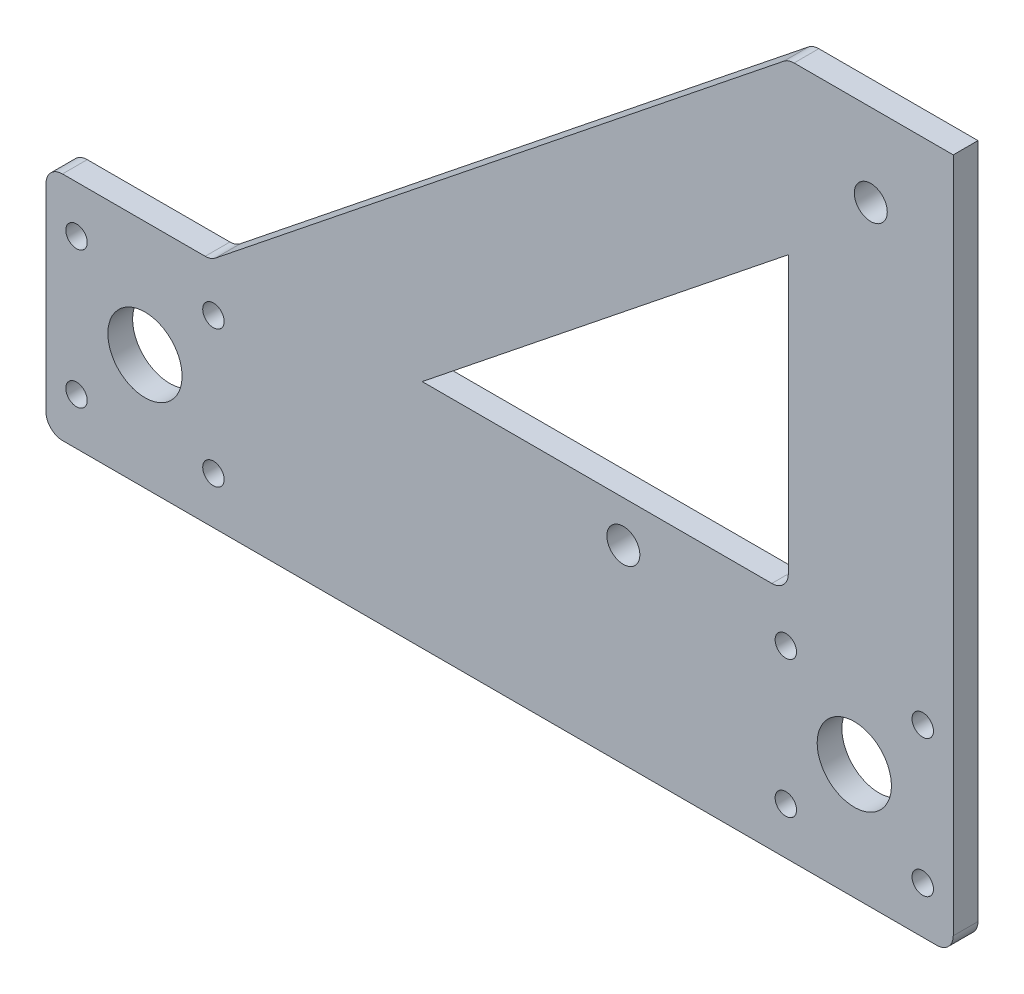
ISO-10303-21;
HEADER;
FILE_DESCRIPTION(('STEP AP214'),'2;1');
FILE_NAME('part.step','',(''),(''),'','','');
FILE_SCHEMA(('AUTOMOTIVE_DESIGN { 1 0 10303 214 1 1 1 1 }'));
ENDSEC;
DATA;
#1=APPLICATION_CONTEXT('core data for automotive mechanical design processes');
#2=APPLICATION_PROTOCOL_DEFINITION('international standard','automotive_design',2000,#1);
#3=PRODUCT_CONTEXT('',#1,'mechanical');
#4=PRODUCT('Part','Part','',(#3));
#5=PRODUCT_RELATED_PRODUCT_CATEGORY('part','',(#4));
#6=PRODUCT_DEFINITION_FORMATION('','',#4);
#7=PRODUCT_DEFINITION_CONTEXT('part definition',#1,'design');
#8=PRODUCT_DEFINITION('design','',#6,#7);
#9=PRODUCT_DEFINITION_SHAPE('','',#8);
#10=(LENGTH_UNIT() NAMED_UNIT(*) SI_UNIT(.MILLI.,.METRE.));
#11=(NAMED_UNIT(*) PLANE_ANGLE_UNIT() SI_UNIT($,.RADIAN.));
#12=(NAMED_UNIT(*) SI_UNIT($,.STERADIAN.) SOLID_ANGLE_UNIT());
#13=UNCERTAINTY_MEASURE_WITH_UNIT(LENGTH_MEASURE(1.E-05),#10,'distance_accuracy_value','');
#14=(GEOMETRIC_REPRESENTATION_CONTEXT(3) GLOBAL_UNCERTAINTY_ASSIGNED_CONTEXT((#13)) GLOBAL_UNIT_ASSIGNED_CONTEXT((#10,
#11,#12)) REPRESENTATION_CONTEXT('',''));
#15=CARTESIAN_POINT('',(0.,0.,0.));
#16=DIRECTION('',(0.,0.,1.));
#17=DIRECTION('',(1.,0.,0.));
#18=AXIS2_PLACEMENT_3D('',#15,#16,#17);
#19=CARTESIAN_POINT('',(-6.66133814775094E-13,1.19348975147204E-12,1282.5));
#20=DIRECTION('',(0.,-1.,0.));
#21=DIRECTION('',(-0.999999999999995,0.,0.));
#22=AXIS2_PLACEMENT_3D('',#19,#20,#21);
#23=PLANE('',#22);
#24=DIRECTION('',(0.,0.,1.));
#25=VECTOR('',#24,1.);
#26=CARTESIAN_POINT('',(-453.507810593577,7.35522753814166E-13,1282.5));
#27=LINE('',#26,#25);
#28=CARTESIAN_POINT('',(-453.507810593573,7.35522753814171E-13,1267.5));
#29=VERTEX_POINT('',#28);
#30=CARTESIAN_POINT('',(-453.507810593577,7.35522753814166E-13,1282.5));
#31=VERTEX_POINT('',#30);
#32=EDGE_CURVE('E11',#29,#31,#27,.T.);
#33=ORIENTED_EDGE('',*,*,#32,.F.);
#34=DIRECTION('',(0.999999999999995,0.,0.));
#35=VECTOR('',#34,1.);
#36=CARTESIAN_POINT('',(-7.18435727575795E-13,7.42603149624351E-13,1267.5));
#37=LINE('',#36,#35);
#38=CARTESIAN_POINT('',(-539.999999999992,1.22124532708767E-12,1267.5));
#39=VERTEX_POINT('',#38);
#40=EDGE_CURVE('E128',#29,#39,#37,.F.);
#41=ORIENTED_EDGE('',*,*,#40,.T.);
#42=DIRECTION('',(0.,0.,1.));
#43=VECTOR('',#42,1.);
#44=CARTESIAN_POINT('',(-539.999999999998,1.22124532708767E-12,1282.5));
#45=LINE('',#44,#43);
#46=CARTESIAN_POINT('',(-539.999999999998,1.22124532708767E-12,1282.5));
#47=VERTEX_POINT('',#46);
#48=EDGE_CURVE('E47',#39,#47,#45,.T.);
#49=ORIENTED_EDGE('',*,*,#48,.T.);
#50=DIRECTION('',(-0.999999999999995,0.,0.));
#51=VECTOR('',#50,1.);
#52=CARTESIAN_POINT('',(-6.66133814775094E-13,1.19348975147204E-12,1282.5));
#53=LINE('',#52,#51);
#54=EDGE_CURVE('E232',#31,#47,#53,.T.);
#55=ORIENTED_EDGE('',*,*,#54,.F.);
#56=EDGE_LOOP('',(#33,#41,#49,#55));
#57=FACE_BOUND('',#56,.T.);
#58=ADVANCED_FACE('F37',(#57),#23,.F.);
#59=CARTESIAN_POINT('',(-539.999999999997,-9.99999999999883,1282.5));
#60=DIRECTION('',(0.,0.,-1.));
#61=DIRECTION('',(-1.,0.,0.));
#62=AXIS2_PLACEMENT_3D('',#59,#60,#61);
#63=CYLINDRICAL_SURFACE('',#62,10.);
#64=ORIENTED_EDGE('',*,*,#48,.F.);
#65=CARTESIAN_POINT('',(-539.999999999997,-9.99999999999883,1267.5));
#66=DIRECTION('',(0.,0.,1.));
#67=DIRECTION('',(1.,0.,0.));
#68=AXIS2_PLACEMENT_3D('',#65,#66,#67);
#69=CIRCLE('',#68,10.);
#70=CARTESIAN_POINT('',(-549.999999999991,-9.99999999999837,1267.5));
#71=VERTEX_POINT('',#70);
#72=EDGE_CURVE('E159',#71,#39,#69,.F.);
#73=ORIENTED_EDGE('',*,*,#72,.F.);
#74=DIRECTION('',(0.,0.,1.));
#75=VECTOR('',#74,1.);
#76=CARTESIAN_POINT('',(-549.999999999996,-9.99999999999847,1282.5));
#77=LINE('',#76,#75);
#78=CARTESIAN_POINT('',(-549.999999999996,-9.99999999999847,1282.5));
#79=VERTEX_POINT('',#78);
#80=EDGE_CURVE('E225',#71,#79,#77,.T.);
#81=ORIENTED_EDGE('',*,*,#80,.T.);
#82=CARTESIAN_POINT('',(-539.999999999997,-9.99999999999883,1282.5));
#83=DIRECTION('',(0.,0.,1.));
#84=DIRECTION('',(0.999999999999995,0.,0.));
#85=AXIS2_PLACEMENT_3D('',#82,#83,#84);
#86=CIRCLE('',#85,10.);
#87=EDGE_CURVE('E243',#79,#47,#86,.F.);
#88=ORIENTED_EDGE('',*,*,#87,.T.);
#89=EDGE_LOOP('',(#64,#73,#81,#88));
#90=FACE_BOUND('',#89,.T.);
#91=ADVANCED_FACE('F246',(#90),#63,.T.);
#92=CARTESIAN_POINT('',(-549.999999999991,1.69309011255336E-12,1282.5));
#93=DIRECTION('',(1.,0.,0.));
#94=DIRECTION('',(0.,-0.999999999999995,0.));
#95=AXIS2_PLACEMENT_3D('',#92,#93,#94);
#96=PLANE('',#95);
#97=ORIENTED_EDGE('',*,*,#80,.F.);
#98=DIRECTION('',(0.,-0.999999999999995,0.));
#99=VECTOR('',#98,1.);
#100=CARTESIAN_POINT('',(-549.999999999991,1.18490287026596E-12,1267.5));
#101=LINE('',#100,#99);
#102=CARTESIAN_POINT('',(-549.999999999988,-129.999999999997,1267.5));
#103=VERTEX_POINT('',#102);
#104=EDGE_CURVE('E156',#71,#103,#101,.T.);
#105=ORIENTED_EDGE('',*,*,#104,.T.);
#106=DIRECTION('',(0.,0.,1.));
#107=VECTOR('',#106,1.);
#108=CARTESIAN_POINT('',(-549.999999999994,-129.999999999998,1282.5));
#109=LINE('',#108,#107);
#110=CARTESIAN_POINT('',(-549.999999999994,-129.999999999998,1282.5));
#111=VERTEX_POINT('',#110);
#112=EDGE_CURVE('E222',#103,#111,#109,.T.);
#113=ORIENTED_EDGE('',*,*,#112,.T.);
#114=DIRECTION('',(0.,-0.999999999999995,0.));
#115=VECTOR('',#114,1.);
#116=CARTESIAN_POINT('',(-549.999999999991,1.69309011255336E-12,1282.5));
#117=LINE('',#116,#115);
#118=EDGE_CURVE('E247',#79,#111,#117,.T.);
#119=ORIENTED_EDGE('',*,*,#118,.F.);
#120=EDGE_LOOP('',(#97,#105,#113,#119));
#121=FACE_BOUND('',#120,.T.);
#122=ADVANCED_FACE('F389',(#121),#96,.F.);
#123=CARTESIAN_POINT('',(-539.999999999995,-129.999999999999,1282.5));
#124=DIRECTION('',(0.,0.,-1.));
#125=DIRECTION('',(-1.,0.,0.));
#126=AXIS2_PLACEMENT_3D('',#123,#124,#125);
#127=CYLINDRICAL_SURFACE('',#126,10.);
#128=ORIENTED_EDGE('',*,*,#112,.F.);
#129=CARTESIAN_POINT('',(-539.999999999995,-129.999999999999,1267.5));
#130=DIRECTION('',(0.,0.,1.));
#131=DIRECTION('',(1.,0.,0.));
#132=AXIS2_PLACEMENT_3D('',#129,#130,#131);
#133=CIRCLE('',#132,10.);
#134=CARTESIAN_POINT('',(-539.99999999999,-139.999999999999,1267.5));
#135=VERTEX_POINT('',#134);
#136=EDGE_CURVE('E153',#135,#103,#133,.F.);
#137=ORIENTED_EDGE('',*,*,#136,.F.);
#138=DIRECTION('',(0.,0.,1.));
#139=VECTOR('',#138,1.);
#140=CARTESIAN_POINT('',(-539.999999999995,-140.,1282.5));
#141=LINE('',#140,#139);
#142=CARTESIAN_POINT('',(-539.999999999995,-140.,1282.5));
#143=VERTEX_POINT('',#142);
#144=EDGE_CURVE('E219',#135,#143,#141,.T.);
#145=ORIENTED_EDGE('',*,*,#144,.T.);
#146=CARTESIAN_POINT('',(-539.999999999995,-129.999999999999,1282.5));
#147=DIRECTION('',(0.,0.,1.));
#148=DIRECTION('',(0.999999999999995,0.,0.));
#149=AXIS2_PLACEMENT_3D('',#146,#147,#148);
#150=CIRCLE('',#149,10.);
#151=EDGE_CURVE('E249',#143,#111,#150,.F.);
#152=ORIENTED_EDGE('',*,*,#151,.T.);
#153=EDGE_LOOP('',(#128,#137,#145,#152));
#154=FACE_BOUND('',#153,.T.);
#155=ADVANCED_FACE('F416',(#154),#127,.T.);
#156=CARTESIAN_POINT('',(2.55351295663786E-12,-139.999999999999,1282.5));
#157=DIRECTION('',(0.,1.,0.));
#158=DIRECTION('',(0.999999999999995,0.,0.));
#159=AXIS2_PLACEMENT_3D('',#156,#157,#158);
#160=PLANE('',#159);
#161=ORIENTED_EDGE('',*,*,#144,.F.);
#162=DIRECTION('',(0.999999999999995,0.,0.));
#163=VECTOR('',#162,1.);
#164=CARTESIAN_POINT('',(-7.16249975996065E-13,-139.999999999999,1267.5));
#165=LINE('',#164,#163);
#166=CARTESIAN_POINT('',(-9.99999999999708,-139.999999999998,1267.5));
#167=VERTEX_POINT('',#166);
#168=EDGE_CURVE('E150',#135,#167,#165,.T.);
#169=ORIENTED_EDGE('',*,*,#168,.T.);
#170=DIRECTION('',(0.,0.,1.));
#171=VECTOR('',#170,1.);
#172=CARTESIAN_POINT('',(-9.99999999999712,-140.,1282.5));
#173=LINE('',#172,#171);
#174=CARTESIAN_POINT('',(-9.99999999999712,-140.,1282.5));
#175=VERTEX_POINT('',#174);
#176=EDGE_CURVE('E216',#167,#175,#173,.T.);
#177=ORIENTED_EDGE('',*,*,#176,.T.);
#178=DIRECTION('',(0.999999999999995,0.,0.));
#179=VECTOR('',#178,1.);
#180=CARTESIAN_POINT('',(2.55351295663786E-12,-139.999999999999,1282.5));
#181=LINE('',#180,#179);
#182=EDGE_CURVE('E256',#143,#175,#181,.T.);
#183=ORIENTED_EDGE('',*,*,#182,.F.);
#184=EDGE_LOOP('',(#161,#169,#177,#183));
#185=FACE_BOUND('',#184,.T.);
#186=ADVANCED_FACE('F412',(#185),#160,.F.);
#187=CARTESIAN_POINT('',(-9.99999999999968,-130.,1282.5));
#188=DIRECTION('',(0.,0.,-1.));
#189=DIRECTION('',(-1.,0.,0.));
#190=AXIS2_PLACEMENT_3D('',#187,#188,#189);
#191=CYLINDRICAL_SURFACE('',#190,10.);
#192=ORIENTED_EDGE('',*,*,#176,.F.);
#193=CARTESIAN_POINT('',(-9.99999999999973,-130.,1267.5));
#194=DIRECTION('',(0.,0.,1.));
#195=DIRECTION('',(1.,0.,0.));
#196=AXIS2_PLACEMENT_3D('',#193,#194,#195);
#197=CIRCLE('',#196,10.);
#198=CARTESIAN_POINT('',(1.05792111182444E-12,-129.999999999997,1267.5));
#199=VERTEX_POINT('',#198);
#200=EDGE_CURVE('E147',#199,#167,#197,.F.);
#201=ORIENTED_EDGE('',*,*,#200,.F.);
#202=DIRECTION('',(0.,0.,1.));
#203=VECTOR('',#202,1.);
#204=CARTESIAN_POINT('',(1.11022302462516E-12,-129.999999999998,1282.5));
#205=LINE('',#204,#203);
#206=CARTESIAN_POINT('',(1.11022302462516E-12,-129.999999999998,1282.5));
#207=VERTEX_POINT('',#206);
#208=EDGE_CURVE('E213',#199,#207,#205,.T.);
#209=ORIENTED_EDGE('',*,*,#208,.T.);
#210=CARTESIAN_POINT('',(-9.99999999999968,-130.,1282.5));
#211=DIRECTION('',(0.,0.,1.));
#212=DIRECTION('',(0.999999999999995,0.,0.));
#213=AXIS2_PLACEMENT_3D('',#210,#211,#212);
#214=CIRCLE('',#213,10.);
#215=EDGE_CURVE('E259',#207,#175,#214,.F.);
#216=ORIENTED_EDGE('',*,*,#215,.T.);
#217=EDGE_LOOP('',(#192,#201,#209,#216));
#218=FACE_BOUND('',#217,.T.);
#219=ADVANCED_FACE('F409',(#218),#191,.T.);
#220=CARTESIAN_POINT('',(-6.66133814775094E-13,1.19348975147204E-12,1282.5));
#221=DIRECTION('',(-1.,0.,0.));
#222=DIRECTION('',(0.,0.999999999999995,0.));
#223=AXIS2_PLACEMENT_3D('',#220,#221,#222);
#224=PLANE('',#223);
#225=ORIENTED_EDGE('',*,*,#208,.F.);
#226=DIRECTION('',(0.,-0.999999999999995,0.));
#227=VECTOR('',#226,1.);
#228=CARTESIAN_POINT('',(1.05589148535755E-12,1.19348975147204E-12,1267.5));
#229=LINE('',#228,#227);
#230=CARTESIAN_POINT('',(8.35876506899409E-13,279.999999999999,1267.5));
#231=VERTEX_POINT('',#230);
#232=EDGE_CURVE('E144',#199,#231,#229,.F.);
#233=ORIENTED_EDGE('',*,*,#232,.T.);
#234=DIRECTION('',(0.,0.,1.));
#235=VECTOR('',#234,1.);
#236=CARTESIAN_POINT('',(8.88178419700125E-13,280.000000000002,1282.5));
#237=LINE('',#236,#235);
#238=CARTESIAN_POINT('',(8.88178419700125E-13,280.000000000002,1282.5));
#239=VERTEX_POINT('',#238);
#240=EDGE_CURVE('E210',#231,#239,#237,.T.);
#241=ORIENTED_EDGE('',*,*,#240,.T.);
#242=DIRECTION('',(0.,0.999999999999995,0.));
#243=VECTOR('',#242,1.);
#244=CARTESIAN_POINT('',(-6.66133814775094E-13,1.19348975147204E-12,1282.5));
#245=LINE('',#244,#243);
#246=EDGE_CURVE('E262',#207,#239,#245,.T.);
#247=ORIENTED_EDGE('',*,*,#246,.F.);
#248=EDGE_LOOP('',(#225,#233,#241,#247));
#249=FACE_BOUND('',#248,.T.);
#250=ADVANCED_FACE('F349',(#249),#224,.F.);
#251=CARTESIAN_POINT('',(8.88178419700125E-13,280.000000000002,1282.5));
#252=DIRECTION('',(0.,1.,0.));
#253=DIRECTION('',(0.999999999999995,0.,0.));
#254=AXIS2_PLACEMENT_3D('',#251,#252,#253);
#255=PLANE('',#254);
#256=ORIENTED_EDGE('',*,*,#240,.F.);
#257=DIRECTION('',(0.999999999999995,0.,0.));
#258=VECTOR('',#257,1.);
#259=CARTESIAN_POINT('',(-7.22807230735257E-13,279.999999999998,1267.5));
#260=LINE('',#259,#258);
#261=CARTESIAN_POINT('',(-96.4921894064147,279.999999999998,1267.5));
#262=VERTEX_POINT('',#261);
#263=EDGE_CURVE('E141',#262,#231,#260,.T.);
#264=ORIENTED_EDGE('',*,*,#263,.F.);
#265=DIRECTION('',(0.,0.,1.));
#266=VECTOR('',#265,1.);
#267=CARTESIAN_POINT('',(-96.4921894064156,280.000000000001,1282.5));
#268=LINE('',#267,#266);
#269=CARTESIAN_POINT('',(-96.4921894064156,280.000000000001,1282.5));
#270=VERTEX_POINT('',#269);
#271=EDGE_CURVE('E208',#262,#270,#268,.T.);
#272=ORIENTED_EDGE('',*,*,#271,.T.);
#273=DIRECTION('',(0.999999999999995,0.,0.));
#274=VECTOR('',#273,1.);
#275=CARTESIAN_POINT('',(8.88178419700125E-13,280.000000000002,1282.5));
#276=LINE('',#275,#274);
#277=EDGE_CURVE('E265',#270,#239,#276,.T.);
#278=ORIENTED_EDGE('',*,*,#277,.T.);
#279=EDGE_LOOP('',(#256,#264,#272,#278));
#280=FACE_BOUND('',#279,.T.);
#281=ADVANCED_FACE('F356',(#280),#255,.T.);
#282=CARTESIAN_POINT('',(-96.4921894064141,270.,1282.5));
#283=DIRECTION('',(0.,0.,-1.));
#284=DIRECTION('',(-1.,0.,0.));
#285=AXIS2_PLACEMENT_3D('',#282,#283,#284);
#286=CYLINDRICAL_SURFACE('',#285,10.);
#287=ORIENTED_EDGE('',*,*,#271,.F.);
#288=CARTESIAN_POINT('',(-96.4921894064142,270.,1267.5));
#289=DIRECTION('',(0.,0.,1.));
#290=DIRECTION('',(1.,0.,0.));
#291=AXIS2_PLACEMENT_3D('',#288,#289,#290);
#292=CIRCLE('',#291,10.);
#293=CARTESIAN_POINT('',(-102.739139881957,277.808688094429,1267.5));
#294=VERTEX_POINT('',#293);
#295=EDGE_CURVE('E138',#294,#262,#292,.F.);
#296=ORIENTED_EDGE('',*,*,#295,.F.);
#297=DIRECTION('',(0.,0.,1.));
#298=VECTOR('',#297,1.);
#299=CARTESIAN_POINT('',(-102.739139881958,277.808688094431,1282.5));
#300=LINE('',#299,#298);
#301=CARTESIAN_POINT('',(-102.739139881958,277.808688094431,1282.5));
#302=VERTEX_POINT('',#301);
#303=EDGE_CURVE('E55',#294,#302,#300,.T.);
#304=ORIENTED_EDGE('',*,*,#303,.T.);
#305=CARTESIAN_POINT('',(-96.4921894064141,270.,1282.5));
#306=DIRECTION('',(0.,0.,1.));
#307=DIRECTION('',(0.999999999999995,0.,0.));
#308=AXIS2_PLACEMENT_3D('',#305,#306,#307);
#309=CIRCLE('',#308,10.);
#310=EDGE_CURVE('E268',#302,#270,#309,.F.);
#311=ORIENTED_EDGE('',*,*,#310,.T.);
#312=EDGE_LOOP('',(#287,#296,#304,#311));
#313=FACE_BOUND('',#312,.T.);
#314=ADVANCED_FACE('F357',(#313),#286,.T.);
#315=CARTESIAN_POINT('',(-449.999999999996,1.85962356624714E-12,1282.5));
#316=DIRECTION('',(-0.624695047554423,0.780868809443031,0.));
#317=DIRECTION('',(0.780868809443025,0.624695047554418,0.));
#318=AXIS2_PLACEMENT_3D('',#315,#316,#317);
#319=PLANE('',#318);
#320=ORIENTED_EDGE('',*,*,#303,.F.);
#321=DIRECTION('',(0.780868809443025,0.624695047554418,0.));
#322=VECTOR('',#321,1.);
#323=CARTESIAN_POINT('',(-449.999999999996,1.85962356624714E-12,1267.5));
#324=LINE('',#323,#322);
#325=CARTESIAN_POINT('',(-447.26086011803,2.19131190557082,1267.5));
#326=VERTEX_POINT('',#325);
#327=EDGE_CURVE('E126',#326,#294,#324,.T.);
#328=ORIENTED_EDGE('',*,*,#327,.F.);
#329=DIRECTION('',(0.,0.,1.));
#330=VECTOR('',#329,1.);
#331=CARTESIAN_POINT('',(-447.260860118034,2.19131190557084,1282.5));
#332=LINE('',#331,#330);
#333=CARTESIAN_POINT('',(-447.260860118034,2.19131190557084,1282.5));
#334=VERTEX_POINT('',#333);
#335=EDGE_CURVE('E41',#326,#334,#332,.T.);
#336=ORIENTED_EDGE('',*,*,#335,.T.);
#337=DIRECTION('',(0.780868809443025,0.624695047554418,0.));
#338=VECTOR('',#337,1.);
#339=CARTESIAN_POINT('',(-449.999999999996,1.85962356624714E-12,1282.5));
#340=LINE('',#339,#338);
#341=EDGE_CURVE('E358',#334,#302,#340,.T.);
#342=ORIENTED_EDGE('',*,*,#341,.T.);
#343=EDGE_LOOP('',(#320,#328,#336,#342));
#344=FACE_BOUND('',#343,.T.);
#345=ADVANCED_FACE('F130',(#344),#319,.T.);
#346=CARTESIAN_POINT('',(-99.9999999999973,8.04911692853238E-13,1282.5));
#347=DIRECTION('',(-1.,0.,0.));
#348=DIRECTION('',(0.,0.999999999999995,0.));
#349=AXIS2_PLACEMENT_3D('',#346,#347,#348);
#350=PLANE('',#349);
#351=DIRECTION('',(0.,0.,1.));
#352=VECTOR('',#351,1.);
#353=CARTESIAN_POINT('',(-99.9999999999963,177.550012201074,1282.5));
#354=LINE('',#353,#352);
#355=CARTESIAN_POINT('',(-99.9999999999954,177.550012201072,1267.5));
#356=VERTEX_POINT('',#355);
#357=CARTESIAN_POINT('',(-99.9999999999963,177.550012201074,1282.5));
#358=VERTEX_POINT('',#357);
#359=EDGE_CURVE('E120',#356,#358,#354,.T.);
#360=ORIENTED_EDGE('',*,*,#359,.F.);
#361=DIRECTION('',(0.,-0.999999999999995,0.));
#362=VECTOR('',#361,1.);
#363=CARTESIAN_POINT('',(-99.9999999999986,1.19192850034366E-12,1267.5));
#364=LINE('',#363,#362);
#365=CARTESIAN_POINT('',(-99.9999999999986,10.0000000000012,1267.5));
#366=VERTEX_POINT('',#365);
#367=EDGE_CURVE('E308',#366,#356,#364,.F.);
#368=ORIENTED_EDGE('',*,*,#367,.F.);
#369=DIRECTION('',(0.,0.,1.));
#370=VECTOR('',#369,1.);
#371=CARTESIAN_POINT('',(-99.9999999999995,10.0000000000013,1282.5));
#372=LINE('',#371,#370);
#373=CARTESIAN_POINT('',(-99.9999999999995,10.0000000000013,1282.5));
#374=VERTEX_POINT('',#373);
#375=EDGE_CURVE('E198',#366,#374,#372,.T.);
#376=ORIENTED_EDGE('',*,*,#375,.T.);
#377=DIRECTION('',(0.,0.999999999999995,0.));
#378=VECTOR('',#377,1.);
#379=CARTESIAN_POINT('',(-99.9999999999973,8.04911692853238E-13,1282.5));
#380=LINE('',#379,#378);
#381=EDGE_CURVE('E364',#374,#358,#380,.T.);
#382=ORIENTED_EDGE('',*,*,#381,.T.);
#383=EDGE_LOOP('',(#360,#368,#376,#382));
#384=FACE_BOUND('',#383,.T.);
#385=ADVANCED_FACE('F373',(#384),#350,.T.);
#386=CARTESIAN_POINT('',(-109.999999999996,10.0000000000014,1282.5));
#387=DIRECTION('',(0.,0.,-1.));
#388=DIRECTION('',(-1.,0.,0.));
#389=AXIS2_PLACEMENT_3D('',#386,#387,#388);
#390=CYLINDRICAL_SURFACE('',#389,10.);
#391=ORIENTED_EDGE('',*,*,#375,.F.);
#392=CARTESIAN_POINT('',(-109.999999999996,10.0000000000014,1267.5));
#393=DIRECTION('',(0.,0.,1.));
#394=DIRECTION('',(1.,0.,0.));
#395=AXIS2_PLACEMENT_3D('',#392,#393,#394);
#396=CIRCLE('',#395,10.);
#397=CARTESIAN_POINT('',(-109.999999999995,1.33226762955019E-12,1267.5));
#398=VERTEX_POINT('',#397);
#399=EDGE_CURVE('E134',#398,#366,#396,.T.);
#400=ORIENTED_EDGE('',*,*,#399,.F.);
#401=DIRECTION('',(0.,0.,1.));
#402=VECTOR('',#401,1.);
#403=CARTESIAN_POINT('',(-109.999999999996,1.33226762955019E-12,1282.5));
#404=LINE('',#403,#402);
#405=CARTESIAN_POINT('',(-109.999999999996,1.33226762955019E-12,1282.5));
#406=VERTEX_POINT('',#405);
#407=EDGE_CURVE('E195',#398,#406,#404,.T.);
#408=ORIENTED_EDGE('',*,*,#407,.T.);
#409=CARTESIAN_POINT('',(-109.999999999996,10.0000000000014,1282.5));
#410=DIRECTION('',(0.,0.,1.));
#411=DIRECTION('',(0.999999999999995,0.,0.));
#412=AXIS2_PLACEMENT_3D('',#409,#410,#411);
#413=CIRCLE('',#412,10.);
#414=EDGE_CURVE('E332',#406,#374,#413,.T.);
#415=ORIENTED_EDGE('',*,*,#414,.T.);
#416=EDGE_LOOP('',(#391,#400,#408,#415));
#417=FACE_BOUND('',#416,.T.);
#418=ADVANCED_FACE('F330',(#417),#390,.F.);
#419=ORIENTED_EDGE('',*,*,#407,.F.);
#420=DIRECTION('',(0.999999999999995,0.,0.));
#421=VECTOR('',#420,1.);
#422=CARTESIAN_POINT('',(-7.18435727575795E-13,1.3339850057914E-12,1267.5));
#423=LINE('',#422,#421);
#424=CARTESIAN_POINT('',(-321.937515251339,1.58206781009084E-12,1267.5));
#425=VERTEX_POINT('',#424);
#426=EDGE_CURVE('E302',#398,#425,#423,.F.);
#427=ORIENTED_EDGE('',*,*,#426,.T.);
#428=DIRECTION('',(0.,0.,1.));
#429=VECTOR('',#428,1.);
#430=CARTESIAN_POINT('',(-321.937515251342,1.58206781009085E-12,1282.5));
#431=LINE('',#430,#429);
#432=CARTESIAN_POINT('',(-321.937515251342,1.58206781009085E-12,1282.5));
#433=VERTEX_POINT('',#432);
#434=EDGE_CURVE('E199',#425,#433,#431,.T.);
#435=ORIENTED_EDGE('',*,*,#434,.T.);
#436=EDGE_CURVE('E194',#406,#433,#53,.T.);
#437=ORIENTED_EDGE('',*,*,#436,.F.);
#438=EDGE_LOOP('',(#419,#427,#435,#437));
#439=FACE_BOUND('',#438,.T.);
#440=ADVANCED_FACE('F323',(#439),#23,.F.);
#441=CARTESIAN_POINT('',(-400.024396195644,-62.4695047554409,1282.5));
#442=DIRECTION('',(-0.624695047554423,0.780868809443031,0.));
#443=DIRECTION('',(0.780868809443025,0.624695047554418,0.));
#444=AXIS2_PLACEMENT_3D('',#441,#442,#443);
#445=PLANE('',#444);
#446=DIRECTION('',(0.780868809443025,0.624695047554418,0.));
#447=VECTOR('',#446,1.);
#448=CARTESIAN_POINT('',(-400.024396195644,-62.4695047554409,1267.5));
#449=LINE('',#448,#447);
#450=EDGE_CURVE('E305',#425,#356,#449,.T.);
#451=ORIENTED_EDGE('',*,*,#450,.T.);
#452=ORIENTED_EDGE('',*,*,#359,.T.);
#453=DIRECTION('',(0.780868809443025,0.624695047554418,0.));
#454=VECTOR('',#453,1.);
#455=CARTESIAN_POINT('',(-400.024396195644,-62.4695047554409,1282.5));
#456=LINE('',#455,#454);
#457=EDGE_CURVE('E367',#433,#358,#456,.T.);
#458=ORIENTED_EDGE('',*,*,#457,.F.);
#459=ORIENTED_EDGE('',*,*,#434,.F.);
#460=EDGE_LOOP('',(#451,#452,#458,#459));
#461=FACE_BOUND('',#460,.T.);
#462=ADVANCED_FACE('F313',(#461),#445,.F.);
#463=CARTESIAN_POINT('',(-49.9999999999973,229.999999999999,1282.5));
#464=DIRECTION('',(0.,0.,-1.));
#465=DIRECTION('',(-1.,0.,0.));
#466=AXIS2_PLACEMENT_3D('',#463,#464,#465);
#467=CYLINDRICAL_SURFACE('',#466,10.);
#468=CARTESIAN_POINT('',(-49.9999999999973,229.999999999999,1282.5));
#469=DIRECTION('',(0.,0.,1.));
#470=DIRECTION('',(0.999999999999995,0.,0.));
#471=AXIS2_PLACEMENT_3D('',#468,#469,#470);
#472=CIRCLE('',#471,10.);
#473=CARTESIAN_POINT('',(-39.9999999999973,229.999999999999,1282.5));
#474=VERTEX_POINT('',#473);
#475=EDGE_CURVE('E359',#474,#474,#472,.T.);
#476=ORIENTED_EDGE('',*,*,#475,.T.);
#477=EDGE_LOOP('',(#476));
#478=FACE_BOUND('',#477,.T.);
#479=CARTESIAN_POINT('',(-49.9999999999973,229.999999999999,1267.5));
#480=DIRECTION('',(0.,0.,1.));
#481=DIRECTION('',(1.,0.,0.));
#482=AXIS2_PLACEMENT_3D('',#479,#480,#481);
#483=CIRCLE('',#482,10.);
#484=CARTESIAN_POINT('',(-39.9999999999973,229.999999999999,1267.5));
#485=VERTEX_POINT('',#484);
#486=EDGE_CURVE('E131',#485,#485,#483,.T.);
#487=ORIENTED_EDGE('',*,*,#486,.F.);
#488=EDGE_LOOP('',(#487));
#489=FACE_BOUND('',#488,.T.);
#490=ADVANCED_FACE('F396',(#478,#489),#467,.F.);
#491=CARTESIAN_POINT('',(-453.507810593578,10.000000000001,1282.5));
#492=DIRECTION('',(0.,0.,-1.));
#493=DIRECTION('',(-1.,0.,0.));
#494=AXIS2_PLACEMENT_3D('',#491,#492,#493);
#495=CYLINDRICAL_SURFACE('',#494,10.);
#496=CARTESIAN_POINT('',(-453.507810593578,10.000000000001,1267.5));
#497=DIRECTION('',(0.,0.,1.));
#498=DIRECTION('',(1.,0.,0.));
#499=AXIS2_PLACEMENT_3D('',#496,#497,#498);
#500=CIRCLE('',#499,10.);
#501=EDGE_CURVE('E113',#29,#326,#500,.T.);
#502=ORIENTED_EDGE('',*,*,#501,.F.);
#503=ORIENTED_EDGE('',*,*,#32,.T.);
#504=CARTESIAN_POINT('',(-453.507810593578,10.000000000001,1282.5));
#505=DIRECTION('',(0.,0.,1.));
#506=DIRECTION('',(0.999999999999995,0.,0.));
#507=AXIS2_PLACEMENT_3D('',#504,#505,#506);
#508=CIRCLE('',#507,10.);
#509=EDGE_CURVE('E116',#31,#334,#508,.T.);
#510=ORIENTED_EDGE('',*,*,#509,.T.);
#511=ORIENTED_EDGE('',*,*,#335,.F.);
#512=EDGE_LOOP('',(#502,#503,#510,#511));
#513=FACE_BOUND('',#512,.T.);
#514=ADVANCED_FACE('F112',(#513),#495,.F.);
#515=CARTESIAN_POINT('',(-199.999999999996,-24.9999999999989,1282.5));
#516=DIRECTION('',(0.,0.,-1.));
#517=DIRECTION('',(-1.,0.,0.));
#518=AXIS2_PLACEMENT_3D('',#515,#516,#517);
#519=CYLINDRICAL_SURFACE('',#518,10.);
#520=CARTESIAN_POINT('',(-199.999999999996,-24.9999999999989,1282.5));
#521=DIRECTION('',(0.,0.,-1.));
#522=DIRECTION('',(-0.999999999999995,0.,0.));
#523=AXIS2_PLACEMENT_3D('',#520,#521,#522);
#524=CIRCLE('',#523,10.);
#525=CARTESIAN_POINT('',(-209.999999999996,-24.9999999999989,1282.5));
#526=VERTEX_POINT('',#525);
#527=EDGE_CURVE('E270',#526,#526,#524,.T.);
#528=ORIENTED_EDGE('',*,*,#527,.F.);
#529=EDGE_LOOP('',(#528));
#530=FACE_BOUND('',#529,.T.);
#531=CARTESIAN_POINT('',(-199.999999999996,-24.9999999999989,1267.5));
#532=DIRECTION('',(0.,0.,-1.));
#533=DIRECTION('',(-1.,0.,0.));
#534=AXIS2_PLACEMENT_3D('',#531,#532,#533);
#535=CIRCLE('',#534,10.);
#536=CARTESIAN_POINT('',(-209.999999999996,-24.9999999999989,1267.5));
#537=VERTEX_POINT('',#536);
#538=EDGE_CURVE('E140',#537,#537,#535,.T.);
#539=ORIENTED_EDGE('',*,*,#538,.T.);
#540=EDGE_LOOP('',(#539));
#541=FACE_BOUND('',#540,.T.);
#542=ADVANCED_FACE('F426',(#530,#541),#519,.F.);
#543=CARTESIAN_POINT('',(-59.9999999999976,-69.9999999999982,1282.5));
#544=DIRECTION('',(0.,0.,-1.));
#545=DIRECTION('',(-1.,0.,0.));
#546=AXIS2_PLACEMENT_3D('',#543,#544,#545);
#547=CYLINDRICAL_SURFACE('',#546,22.5);
#548=CARTESIAN_POINT('',(-59.9999999999976,-69.9999999999982,1282.5));
#549=DIRECTION('',(0.,0.,-1.));
#550=DIRECTION('',(-0.999999999999995,0.,0.));
#551=AXIS2_PLACEMENT_3D('',#548,#549,#550);
#552=CIRCLE('',#551,22.5);
#553=CARTESIAN_POINT('',(-82.4999999999975,-69.9999999999982,1282.5));
#554=VERTEX_POINT('',#553);
#555=EDGE_CURVE('E273',#554,#554,#552,.T.);
#556=ORIENTED_EDGE('',*,*,#555,.F.);
#557=EDGE_LOOP('',(#556));
#558=FACE_BOUND('',#557,.T.);
#559=CARTESIAN_POINT('',(-59.9999999999977,-69.9999999999982,1267.5));
#560=DIRECTION('',(0.,0.,-1.));
#561=DIRECTION('',(-1.,0.,0.));
#562=AXIS2_PLACEMENT_3D('',#559,#560,#561);
#563=CIRCLE('',#562,22.5);
#564=CARTESIAN_POINT('',(-82.4999999999976,-69.9999999999982,1267.5));
#565=VERTEX_POINT('',#564);
#566=EDGE_CURVE('E164',#565,#565,#563,.T.);
#567=ORIENTED_EDGE('',*,*,#566,.T.);
#568=EDGE_LOOP('',(#567));
#569=FACE_BOUND('',#568,.T.);
#570=ADVANCED_FACE('F429',(#558,#569),#547,.F.);
#571=CARTESIAN_POINT('',(-101.499999999999,-111.499999999998,1282.5));
#572=DIRECTION('',(0.,0.,-1.));
#573=DIRECTION('',(-1.,0.,0.));
#574=AXIS2_PLACEMENT_3D('',#571,#572,#573);
#575=CYLINDRICAL_SURFACE('',#574,6.4999999999999);
#576=CARTESIAN_POINT('',(-101.499999999999,-111.499999999998,1282.5));
#577=DIRECTION('',(0.,0.,-1.));
#578=DIRECTION('',(-0.999999999999995,0.,0.));
#579=AXIS2_PLACEMENT_3D('',#576,#577,#578);
#580=CIRCLE('',#579,6.4999999999999);
#581=CARTESIAN_POINT('',(-107.999999999999,-111.499999999998,1282.5));
#582=VERTEX_POINT('',#581);
#583=EDGE_CURVE('E276',#582,#582,#580,.T.);
#584=ORIENTED_EDGE('',*,*,#583,.F.);
#585=EDGE_LOOP('',(#584));
#586=FACE_BOUND('',#585,.T.);
#587=CARTESIAN_POINT('',(-101.499999999999,-111.499999999998,1267.5));
#588=DIRECTION('',(0.,0.,-1.));
#589=DIRECTION('',(-1.,0.,0.));
#590=AXIS2_PLACEMENT_3D('',#587,#588,#589);
#591=CIRCLE('',#590,6.4999999999999);
#592=CARTESIAN_POINT('',(-107.999999999999,-111.499999999998,1267.5));
#593=VERTEX_POINT('',#592);
#594=EDGE_CURVE('E167',#593,#593,#591,.T.);
#595=ORIENTED_EDGE('',*,*,#594,.T.);
#596=EDGE_LOOP('',(#595));
#597=FACE_BOUND('',#596,.T.);
#598=ADVANCED_FACE('F433',(#586,#597),#575,.F.);
#599=CARTESIAN_POINT('',(-18.4999999999977,-111.499999999997,1282.5));
#600=DIRECTION('',(0.,0.,-1.));
#601=DIRECTION('',(-1.,0.,0.));
#602=AXIS2_PLACEMENT_3D('',#599,#600,#601);
#603=CYLINDRICAL_SURFACE('',#602,6.4999999999999);
#604=CARTESIAN_POINT('',(-18.4999999999977,-111.499999999997,1282.5));
#605=DIRECTION('',(0.,0.,-1.));
#606=DIRECTION('',(-0.999999999999995,0.,0.));
#607=AXIS2_PLACEMENT_3D('',#604,#605,#606);
#608=CIRCLE('',#607,6.4999999999999);
#609=CARTESIAN_POINT('',(-24.9999999999976,-111.499999999997,1282.5));
#610=VERTEX_POINT('',#609);
#611=EDGE_CURVE('E279',#610,#610,#608,.T.);
#612=ORIENTED_EDGE('',*,*,#611,.F.);
#613=EDGE_LOOP('',(#612));
#614=FACE_BOUND('',#613,.T.);
#615=CARTESIAN_POINT('',(-18.4999999999978,-111.499999999997,1267.5));
#616=DIRECTION('',(0.,0.,-1.));
#617=DIRECTION('',(-1.,0.,0.));
#618=AXIS2_PLACEMENT_3D('',#615,#616,#617);
#619=CIRCLE('',#618,6.4999999999999);
#620=CARTESIAN_POINT('',(-24.9999999999977,-111.499999999997,1267.5));
#621=VERTEX_POINT('',#620);
#622=EDGE_CURVE('E170',#621,#621,#619,.T.);
#623=ORIENTED_EDGE('',*,*,#622,.T.);
#624=EDGE_LOOP('',(#623));
#625=FACE_BOUND('',#624,.T.);
#626=ADVANCED_FACE('F437',(#614,#625),#603,.F.);
#627=CARTESIAN_POINT('',(-18.4999999999962,-28.4999999999979,1282.5));
#628=DIRECTION('',(0.,0.,-1.));
#629=DIRECTION('',(-1.,0.,0.));
#630=AXIS2_PLACEMENT_3D('',#627,#628,#629);
#631=CYLINDRICAL_SURFACE('',#630,6.4999999999999);
#632=CARTESIAN_POINT('',(-18.4999999999962,-28.4999999999979,1282.5));
#633=DIRECTION('',(0.,0.,-1.));
#634=DIRECTION('',(-0.999999999999995,0.,0.));
#635=AXIS2_PLACEMENT_3D('',#632,#633,#634);
#636=CIRCLE('',#635,6.4999999999999);
#637=CARTESIAN_POINT('',(-24.9999999999961,-28.4999999999979,1282.5));
#638=VERTEX_POINT('',#637);
#639=EDGE_CURVE('E282',#638,#638,#636,.T.);
#640=ORIENTED_EDGE('',*,*,#639,.F.);
#641=EDGE_LOOP('',(#640));
#642=FACE_BOUND('',#641,.T.);
#643=CARTESIAN_POINT('',(-18.4999999999962,-28.4999999999979,1267.5));
#644=DIRECTION('',(0.,0.,-1.));
#645=DIRECTION('',(-1.,0.,0.));
#646=AXIS2_PLACEMENT_3D('',#643,#644,#645);
#647=CIRCLE('',#646,6.4999999999999);
#648=CARTESIAN_POINT('',(-24.9999999999961,-28.4999999999979,1267.5));
#649=VERTEX_POINT('',#648);
#650=EDGE_CURVE('E173',#649,#649,#647,.T.);
#651=ORIENTED_EDGE('',*,*,#650,.T.);
#652=EDGE_LOOP('',(#651));
#653=FACE_BOUND('',#652,.T.);
#654=ADVANCED_FACE('F441',(#642,#653),#631,.F.);
#655=CARTESIAN_POINT('',(-101.499999999998,-28.4999999999992,1282.5));
#656=DIRECTION('',(0.,0.,-1.));
#657=DIRECTION('',(-1.,0.,0.));
#658=AXIS2_PLACEMENT_3D('',#655,#656,#657);
#659=CYLINDRICAL_SURFACE('',#658,6.4999999999999);
#660=CARTESIAN_POINT('',(-101.499999999998,-28.4999999999992,1282.5));
#661=DIRECTION('',(0.,0.,-1.));
#662=DIRECTION('',(-0.999999999999995,0.,0.));
#663=AXIS2_PLACEMENT_3D('',#660,#661,#662);
#664=CIRCLE('',#663,6.4999999999999);
#665=CARTESIAN_POINT('',(-107.999999999998,-28.4999999999992,1282.5));
#666=VERTEX_POINT('',#665);
#667=EDGE_CURVE('E285',#666,#666,#664,.T.);
#668=ORIENTED_EDGE('',*,*,#667,.F.);
#669=EDGE_LOOP('',(#668));
#670=FACE_BOUND('',#669,.T.);
#671=CARTESIAN_POINT('',(-101.499999999998,-28.4999999999992,1267.5));
#672=DIRECTION('',(0.,0.,-1.));
#673=DIRECTION('',(-1.,0.,0.));
#674=AXIS2_PLACEMENT_3D('',#671,#672,#673);
#675=CIRCLE('',#674,6.4999999999999);
#676=CARTESIAN_POINT('',(-107.999999999998,-28.4999999999992,1267.5));
#677=VERTEX_POINT('',#676);
#678=EDGE_CURVE('E176',#677,#677,#675,.T.);
#679=ORIENTED_EDGE('',*,*,#678,.T.);
#680=EDGE_LOOP('',(#679));
#681=FACE_BOUND('',#680,.T.);
#682=ADVANCED_FACE('F445',(#670,#681),#659,.F.);
#683=CARTESIAN_POINT('',(-489.999999999996,-69.9999999999986,1282.5));
#684=DIRECTION('',(0.,0.,-1.));
#685=DIRECTION('',(-1.,0.,0.));
#686=AXIS2_PLACEMENT_3D('',#683,#684,#685);
#687=CYLINDRICAL_SURFACE('',#686,22.5);
#688=CARTESIAN_POINT('',(-489.999999999996,-69.9999999999986,1282.5));
#689=DIRECTION('',(0.,0.,-1.));
#690=DIRECTION('',(-0.999999999999995,0.,0.));
#691=AXIS2_PLACEMENT_3D('',#688,#689,#690);
#692=CIRCLE('',#691,22.5);
#693=CARTESIAN_POINT('',(-512.499999999995,-69.9999999999986,1282.5));
#694=VERTEX_POINT('',#693);
#695=EDGE_CURVE('E288',#694,#694,#692,.T.);
#696=ORIENTED_EDGE('',*,*,#695,.F.);
#697=EDGE_LOOP('',(#696));
#698=FACE_BOUND('',#697,.T.);
#699=CARTESIAN_POINT('',(-489.999999999996,-69.9999999999986,1267.5));
#700=DIRECTION('',(0.,0.,-1.));
#701=DIRECTION('',(-1.,0.,0.));
#702=AXIS2_PLACEMENT_3D('',#699,#700,#701);
#703=CIRCLE('',#702,22.5);
#704=CARTESIAN_POINT('',(-512.499999999996,-69.9999999999986,1267.5));
#705=VERTEX_POINT('',#704);
#706=EDGE_CURVE('E179',#705,#705,#703,.T.);
#707=ORIENTED_EDGE('',*,*,#706,.T.);
#708=EDGE_LOOP('',(#707));
#709=FACE_BOUND('',#708,.T.);
#710=ADVANCED_FACE('F449',(#698,#709),#687,.F.);
#711=CARTESIAN_POINT('',(-531.499999999993,-111.499999999998,1282.5));
#712=DIRECTION('',(0.,0.,-1.));
#713=DIRECTION('',(-1.,0.,0.));
#714=AXIS2_PLACEMENT_3D('',#711,#712,#713);
#715=CYLINDRICAL_SURFACE('',#714,6.4999999999999);
#716=CARTESIAN_POINT('',(-531.499999999993,-111.499999999998,1282.5));
#717=DIRECTION('',(0.,0.,-1.));
#718=DIRECTION('',(-0.999999999999995,0.,0.));
#719=AXIS2_PLACEMENT_3D('',#716,#717,#718);
#720=CIRCLE('',#719,6.4999999999999);
#721=CARTESIAN_POINT('',(-537.999999999993,-111.499999999998,1282.5));
#722=VERTEX_POINT('',#721);
#723=EDGE_CURVE('E291',#722,#722,#720,.T.);
#724=ORIENTED_EDGE('',*,*,#723,.F.);
#725=EDGE_LOOP('',(#724));
#726=FACE_BOUND('',#725,.T.);
#727=CARTESIAN_POINT('',(-531.499999999993,-111.499999999998,1267.5));
#728=DIRECTION('',(0.,0.,-1.));
#729=DIRECTION('',(-1.,0.,0.));
#730=AXIS2_PLACEMENT_3D('',#727,#728,#729);
#731=CIRCLE('',#730,6.4999999999999);
#732=CARTESIAN_POINT('',(-537.999999999993,-111.499999999998,1267.5));
#733=VERTEX_POINT('',#732);
#734=EDGE_CURVE('E182',#733,#733,#731,.T.);
#735=ORIENTED_EDGE('',*,*,#734,.T.);
#736=EDGE_LOOP('',(#735));
#737=FACE_BOUND('',#736,.T.);
#738=ADVANCED_FACE('F453',(#726,#737),#715,.F.);
#739=CARTESIAN_POINT('',(-448.499999999993,-111.499999999999,1282.5));
#740=DIRECTION('',(0.,0.,-1.));
#741=DIRECTION('',(-1.,0.,0.));
#742=AXIS2_PLACEMENT_3D('',#739,#740,#741);
#743=CYLINDRICAL_SURFACE('',#742,6.4999999999999);
#744=CARTESIAN_POINT('',(-448.499999999993,-111.499999999999,1282.5));
#745=DIRECTION('',(0.,0.,-1.));
#746=DIRECTION('',(-0.999999999999995,0.,0.));
#747=AXIS2_PLACEMENT_3D('',#744,#745,#746);
#748=CIRCLE('',#747,6.4999999999999);
#749=CARTESIAN_POINT('',(-454.999999999993,-111.499999999999,1282.5));
#750=VERTEX_POINT('',#749);
#751=EDGE_CURVE('E294',#750,#750,#748,.T.);
#752=ORIENTED_EDGE('',*,*,#751,.F.);
#753=EDGE_LOOP('',(#752));
#754=FACE_BOUND('',#753,.T.);
#755=CARTESIAN_POINT('',(-448.499999999993,-111.499999999999,1267.5));
#756=DIRECTION('',(0.,0.,-1.));
#757=DIRECTION('',(-1.,0.,0.));
#758=AXIS2_PLACEMENT_3D('',#755,#756,#757);
#759=CIRCLE('',#758,6.4999999999999);
#760=CARTESIAN_POINT('',(-454.999999999993,-111.499999999999,1267.5));
#761=VERTEX_POINT('',#760);
#762=EDGE_CURVE('E185',#761,#761,#759,.T.);
#763=ORIENTED_EDGE('',*,*,#762,.T.);
#764=EDGE_LOOP('',(#763));
#765=FACE_BOUND('',#764,.T.);
#766=ADVANCED_FACE('F457',(#754,#765),#743,.F.);
#767=CARTESIAN_POINT('',(-448.499999999989,-28.4999999999987,1282.5));
#768=DIRECTION('',(0.,0.,-1.));
#769=DIRECTION('',(-1.,0.,0.));
#770=AXIS2_PLACEMENT_3D('',#767,#768,#769);
#771=CYLINDRICAL_SURFACE('',#770,6.4999999999999);
#772=CARTESIAN_POINT('',(-448.499999999989,-28.4999999999987,1282.5));
#773=DIRECTION('',(0.,0.,-1.));
#774=DIRECTION('',(-0.999999999999995,0.,0.));
#775=AXIS2_PLACEMENT_3D('',#772,#773,#774);
#776=CIRCLE('',#775,6.4999999999999);
#777=CARTESIAN_POINT('',(-454.999999999989,-28.4999999999987,1282.5));
#778=VERTEX_POINT('',#777);
#779=EDGE_CURVE('E297',#778,#778,#776,.T.);
#780=ORIENTED_EDGE('',*,*,#779,.F.);
#781=EDGE_LOOP('',(#780));
#782=FACE_BOUND('',#781,.T.);
#783=CARTESIAN_POINT('',(-448.499999999989,-28.4999999999987,1267.5));
#784=DIRECTION('',(0.,0.,-1.));
#785=DIRECTION('',(-1.,0.,0.));
#786=AXIS2_PLACEMENT_3D('',#783,#784,#785);
#787=CIRCLE('',#786,6.4999999999999);
#788=CARTESIAN_POINT('',(-454.999999999989,-28.4999999999987,1267.5));
#789=VERTEX_POINT('',#788);
#790=EDGE_CURVE('E188',#789,#789,#787,.T.);
#791=ORIENTED_EDGE('',*,*,#790,.T.);
#792=EDGE_LOOP('',(#791));
#793=FACE_BOUND('',#792,.T.);
#794=ADVANCED_FACE('F460',(#782,#793),#771,.F.);
#795=CARTESIAN_POINT('',(-531.499999999998,-28.4999999999986,1282.5));
#796=DIRECTION('',(0.,0.,-1.));
#797=DIRECTION('',(-1.,0.,0.));
#798=AXIS2_PLACEMENT_3D('',#795,#796,#797);
#799=CYLINDRICAL_SURFACE('',#798,6.4999999999999);
#800=CARTESIAN_POINT('',(-531.499999999998,-28.4999999999986,1282.5));
#801=DIRECTION('',(0.,0.,-1.));
#802=DIRECTION('',(-0.999999999999995,0.,0.));
#803=AXIS2_PLACEMENT_3D('',#800,#801,#802);
#804=CIRCLE('',#803,6.4999999999999);
#805=CARTESIAN_POINT('',(-537.999999999998,-28.4999999999986,1282.5));
#806=VERTEX_POINT('',#805);
#807=EDGE_CURVE('E206',#806,#806,#804,.T.);
#808=ORIENTED_EDGE('',*,*,#807,.F.);
#809=EDGE_LOOP('',(#808));
#810=FACE_BOUND('',#809,.T.);
#811=CARTESIAN_POINT('',(-531.499999999998,-28.4999999999986,1267.5));
#812=DIRECTION('',(0.,0.,-1.));
#813=DIRECTION('',(-1.,0.,0.));
#814=AXIS2_PLACEMENT_3D('',#811,#812,#813);
#815=CIRCLE('',#814,6.4999999999999);
#816=CARTESIAN_POINT('',(-537.999999999998,-28.4999999999986,1267.5));
#817=VERTEX_POINT('',#816);
#818=EDGE_CURVE('E191',#817,#817,#815,.T.);
#819=ORIENTED_EDGE('',*,*,#818,.T.);
#820=EDGE_LOOP('',(#819));
#821=FACE_BOUND('',#820,.T.);
#822=ADVANCED_FACE('F39',(#810,#821),#799,.F.);
#823=CARTESIAN_POINT('',(-6.66133814775094E-13,1.19348975147204E-12,1282.5));
#824=DIRECTION('',(0.,0.,-1.));
#825=DIRECTION('',(0.999999999999995,0.,0.));
#826=AXIS2_PLACEMENT_3D('',#823,#824,#825);
#827=PLANE('',#826);
#828=ORIENTED_EDGE('',*,*,#436,.T.);
#829=ORIENTED_EDGE('',*,*,#457,.T.);
#830=ORIENTED_EDGE('',*,*,#381,.F.);
#831=ORIENTED_EDGE('',*,*,#414,.F.);
#832=EDGE_LOOP('',(#828,#829,#830,#831));
#833=FACE_BOUND('',#832,.T.);
#834=ORIENTED_EDGE('',*,*,#475,.F.);
#835=EDGE_LOOP('',(#834));
#836=FACE_BOUND('',#835,.T.);
#837=ORIENTED_EDGE('',*,*,#341,.F.);
#838=ORIENTED_EDGE('',*,*,#509,.F.);
#839=ORIENTED_EDGE('',*,*,#54,.T.);
#840=ORIENTED_EDGE('',*,*,#87,.F.);
#841=ORIENTED_EDGE('',*,*,#118,.T.);
#842=ORIENTED_EDGE('',*,*,#151,.F.);
#843=ORIENTED_EDGE('',*,*,#182,.T.);
#844=ORIENTED_EDGE('',*,*,#215,.F.);
#845=ORIENTED_EDGE('',*,*,#246,.T.);
#846=ORIENTED_EDGE('',*,*,#277,.F.);
#847=ORIENTED_EDGE('',*,*,#310,.F.);
#848=EDGE_LOOP('',(#837,#838,#839,#840,#841,#842,#843,#844,#845,#846,#847));
#849=FACE_BOUND('',#848,.T.);
#850=ORIENTED_EDGE('',*,*,#527,.T.);
#851=EDGE_LOOP('',(#850));
#852=FACE_BOUND('',#851,.T.);
#853=ORIENTED_EDGE('',*,*,#555,.T.);
#854=EDGE_LOOP('',(#853));
#855=FACE_BOUND('',#854,.T.);
#856=ORIENTED_EDGE('',*,*,#583,.T.);
#857=EDGE_LOOP('',(#856));
#858=FACE_BOUND('',#857,.T.);
#859=ORIENTED_EDGE('',*,*,#611,.T.);
#860=EDGE_LOOP('',(#859));
#861=FACE_BOUND('',#860,.T.);
#862=ORIENTED_EDGE('',*,*,#639,.T.);
#863=EDGE_LOOP('',(#862));
#864=FACE_BOUND('',#863,.T.);
#865=ORIENTED_EDGE('',*,*,#667,.T.);
#866=EDGE_LOOP('',(#865));
#867=FACE_BOUND('',#866,.T.);
#868=ORIENTED_EDGE('',*,*,#695,.T.);
#869=EDGE_LOOP('',(#868));
#870=FACE_BOUND('',#869,.T.);
#871=ORIENTED_EDGE('',*,*,#723,.T.);
#872=EDGE_LOOP('',(#871));
#873=FACE_BOUND('',#872,.T.);
#874=ORIENTED_EDGE('',*,*,#751,.T.);
#875=EDGE_LOOP('',(#874));
#876=FACE_BOUND('',#875,.T.);
#877=ORIENTED_EDGE('',*,*,#779,.T.);
#878=EDGE_LOOP('',(#877));
#879=FACE_BOUND('',#878,.T.);
#880=ORIENTED_EDGE('',*,*,#807,.T.);
#881=EDGE_LOOP('',(#880));
#882=FACE_BOUND('',#881,.T.);
#883=ADVANCED_FACE('F240',(#833,#836,#849,#852,#855,#858,#861,#864,#867,#870,#873,#876,#879,
#882),#827,.F.);
#884=CARTESIAN_POINT('',(-7.18435727575795E-13,1.19348975147204E-12,1267.5));
#885=DIRECTION('',(0.,0.,-1.));
#886=DIRECTION('',(0.999999999999995,0.,0.));
#887=AXIS2_PLACEMENT_3D('',#884,#885,#886);
#888=PLANE('',#887);
#889=ORIENTED_EDGE('',*,*,#426,.F.);
#890=ORIENTED_EDGE('',*,*,#399,.T.);
#891=ORIENTED_EDGE('',*,*,#367,.T.);
#892=ORIENTED_EDGE('',*,*,#450,.F.);
#893=EDGE_LOOP('',(#889,#890,#891,#892));
#894=FACE_BOUND('',#893,.T.);
#895=ORIENTED_EDGE('',*,*,#486,.T.);
#896=EDGE_LOOP('',(#895));
#897=FACE_BOUND('',#896,.T.);
#898=ORIENTED_EDGE('',*,*,#327,.T.);
#899=ORIENTED_EDGE('',*,*,#295,.T.);
#900=ORIENTED_EDGE('',*,*,#263,.T.);
#901=ORIENTED_EDGE('',*,*,#232,.F.);
#902=ORIENTED_EDGE('',*,*,#200,.T.);
#903=ORIENTED_EDGE('',*,*,#168,.F.);
#904=ORIENTED_EDGE('',*,*,#136,.T.);
#905=ORIENTED_EDGE('',*,*,#104,.F.);
#906=ORIENTED_EDGE('',*,*,#72,.T.);
#907=ORIENTED_EDGE('',*,*,#40,.F.);
#908=ORIENTED_EDGE('',*,*,#501,.T.);
#909=EDGE_LOOP('',(#898,#899,#900,#901,#902,#903,#904,#905,#906,#907,#908));
#910=FACE_BOUND('',#909,.T.);
#911=ORIENTED_EDGE('',*,*,#538,.F.);
#912=EDGE_LOOP('',(#911));
#913=FACE_BOUND('',#912,.T.);
#914=ORIENTED_EDGE('',*,*,#566,.F.);
#915=EDGE_LOOP('',(#914));
#916=FACE_BOUND('',#915,.T.);
#917=ORIENTED_EDGE('',*,*,#594,.F.);
#918=EDGE_LOOP('',(#917));
#919=FACE_BOUND('',#918,.T.);
#920=ORIENTED_EDGE('',*,*,#622,.F.);
#921=EDGE_LOOP('',(#920));
#922=FACE_BOUND('',#921,.T.);
#923=ORIENTED_EDGE('',*,*,#650,.F.);
#924=EDGE_LOOP('',(#923));
#925=FACE_BOUND('',#924,.T.);
#926=ORIENTED_EDGE('',*,*,#678,.F.);
#927=EDGE_LOOP('',(#926));
#928=FACE_BOUND('',#927,.T.);
#929=ORIENTED_EDGE('',*,*,#706,.F.);
#930=EDGE_LOOP('',(#929));
#931=FACE_BOUND('',#930,.T.);
#932=ORIENTED_EDGE('',*,*,#734,.F.);
#933=EDGE_LOOP('',(#932));
#934=FACE_BOUND('',#933,.T.);
#935=ORIENTED_EDGE('',*,*,#762,.F.);
#936=EDGE_LOOP('',(#935));
#937=FACE_BOUND('',#936,.T.);
#938=ORIENTED_EDGE('',*,*,#790,.F.);
#939=EDGE_LOOP('',(#938));
#940=FACE_BOUND('',#939,.T.);
#941=ORIENTED_EDGE('',*,*,#818,.F.);
#942=EDGE_LOOP('',(#941));
#943=FACE_BOUND('',#942,.T.);
#944=ADVANCED_FACE('F123',(#894,#897,#910,#913,#916,#919,#922,#925,#928,#931,#934,#937,#940,
#943),#888,.T.);
#945=CLOSED_SHELL('',(#58,#91,#122,#155,#186,#219,#250,#281,#314,#345,#385,#418,#440,#462,#490,
#514,#542,#570,#598,#626,#654,#682,#710,#738,#766,#794,#822,#883,#944));
#946=MANIFOLD_SOLID_BREP('B2',#945);
#947=ADVANCED_BREP_SHAPE_REPRESENTATION('',(#18,#946),#14);
#948=SHAPE_DEFINITION_REPRESENTATION(#9,#947);
ENDSEC;
END-ISO-10303-21;
